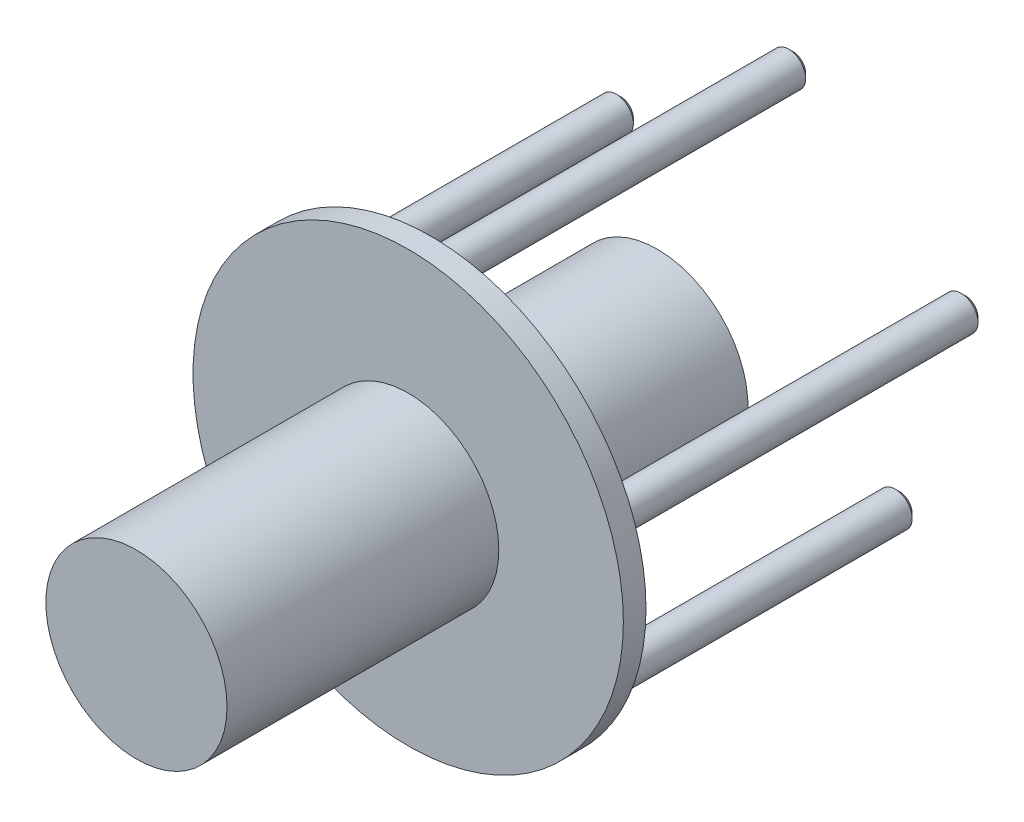
ISO-10303-21;
HEADER;
FILE_DESCRIPTION(('STEP AP214'),'2;1');
FILE_NAME('part.step','',(''),(''),'','','');
FILE_SCHEMA(('AUTOMOTIVE_DESIGN { 1 0 10303 214 1 1 1 1 }'));
ENDSEC;
DATA;
#1=APPLICATION_CONTEXT('core data for automotive mechanical design processes');
#2=APPLICATION_PROTOCOL_DEFINITION('international standard','automotive_design',2000,#1);
#3=PRODUCT_CONTEXT('',#1,'mechanical');
#4=PRODUCT('Part','Part','',(#3));
#5=PRODUCT_RELATED_PRODUCT_CATEGORY('part','',(#4));
#6=PRODUCT_DEFINITION_FORMATION('','',#4);
#7=PRODUCT_DEFINITION_CONTEXT('part definition',#1,'design');
#8=PRODUCT_DEFINITION('design','',#6,#7);
#9=PRODUCT_DEFINITION_SHAPE('','',#8);
#10=(LENGTH_UNIT() NAMED_UNIT(*) SI_UNIT(.MILLI.,.METRE.));
#11=(NAMED_UNIT(*) PLANE_ANGLE_UNIT() SI_UNIT($,.RADIAN.));
#12=(NAMED_UNIT(*) SI_UNIT($,.STERADIAN.) SOLID_ANGLE_UNIT());
#13=UNCERTAINTY_MEASURE_WITH_UNIT(LENGTH_MEASURE(1.E-05),#10,'distance_accuracy_value','');
#14=(GEOMETRIC_REPRESENTATION_CONTEXT(3) GLOBAL_UNCERTAINTY_ASSIGNED_CONTEXT((#13)) GLOBAL_UNIT_ASSIGNED_CONTEXT((#10,
#11,#12)) REPRESENTATION_CONTEXT('',''));
#15=CARTESIAN_POINT('',(0.,0.,0.));
#16=DIRECTION('',(0.,0.,1.));
#17=DIRECTION('',(1.,0.,0.));
#18=AXIS2_PLACEMENT_3D('',#15,#16,#17);
#19=CARTESIAN_POINT('',(-60.5619424894726,11.2111120565077,57.15));
#20=DIRECTION('',(0.,0.,-1.));
#21=DIRECTION('',(-1.,0.,0.));
#22=AXIS2_PLACEMENT_3D('',#19,#20,#21);
#23=CYLINDRICAL_SURFACE('',#22,25.4000000000001);
#24=CARTESIAN_POINT('',(-60.5619424894726,11.2111120565077,57.15));
#25=DIRECTION('',(0.,0.,1.));
#26=DIRECTION('',(1.,0.,0.));
#27=AXIS2_PLACEMENT_3D('',#24,#25,#26);
#28=CIRCLE('',#27,25.4000000000001);
#29=CARTESIAN_POINT('',(-35.1619424894725,11.2111120565077,57.15));
#30=VERTEX_POINT('',#29);
#31=EDGE_CURVE('E53',#30,#30,#28,.T.);
#32=ORIENTED_EDGE('',*,*,#31,.F.);
#33=EDGE_LOOP('',(#32));
#34=FACE_BOUND('',#33,.T.);
#35=CARTESIAN_POINT('',(-60.5619424894727,11.2111120565077,-6.34999999999997));
#36=DIRECTION('',(0.,0.,-1.));
#37=DIRECTION('',(-1.,0.,0.));
#38=AXIS2_PLACEMENT_3D('',#35,#36,#37);
#39=CIRCLE('',#38,25.4000000000001);
#40=CARTESIAN_POINT('',(-85.9619424894728,11.2111120565077,-6.34999999999997));
#41=VERTEX_POINT('',#40);
#42=EDGE_CURVE('E46',#41,#41,#39,.T.);
#43=ORIENTED_EDGE('',*,*,#42,.F.);
#44=EDGE_LOOP('',(#43));
#45=FACE_BOUND('',#44,.T.);
#46=ADVANCED_FACE('F30',(#34,#45),#23,.T.);
#47=CARTESIAN_POINT('',(-60.5619424894726,11.2111120565077,63.5));
#48=DIRECTION('',(0.,0.,-1.));
#49=DIRECTION('',(-1.,0.,0.));
#50=AXIS2_PLACEMENT_3D('',#47,#48,#49);
#51=CYLINDRICAL_SURFACE('',#50,60.325);
#52=CARTESIAN_POINT('',(-60.5619424894726,11.2111120565077,63.5));
#53=DIRECTION('',(0.,0.,1.));
#54=DIRECTION('',(1.,0.,0.));
#55=AXIS2_PLACEMENT_3D('',#52,#53,#54);
#56=CIRCLE('',#55,60.325);
#57=CARTESIAN_POINT('',(-0.236942489472633,11.2111120565077,63.5));
#58=VERTEX_POINT('',#57);
#59=EDGE_CURVE('E50',#58,#58,#56,.T.);
#60=ORIENTED_EDGE('',*,*,#59,.F.);
#61=EDGE_LOOP('',(#60));
#62=FACE_BOUND('',#61,.T.);
#63=CARTESIAN_POINT('',(-60.5619424894726,11.2111120565077,57.15));
#64=DIRECTION('',(0.,0.,1.));
#65=DIRECTION('',(1.,0.,0.));
#66=AXIS2_PLACEMENT_3D('',#63,#64,#65);
#67=CIRCLE('',#66,60.325);
#68=CARTESIAN_POINT('',(-0.236942489472633,11.2111120565077,57.15));
#69=VERTEX_POINT('',#68);
#70=EDGE_CURVE('E49',#69,#69,#67,.T.);
#71=ORIENTED_EDGE('',*,*,#70,.T.);
#72=EDGE_LOOP('',(#71));
#73=FACE_BOUND('',#72,.T.);
#74=ADVANCED_FACE('F116',(#62,#73),#51,.T.);
#75=CARTESIAN_POINT('',(-60.5619424894726,11.2111120565077,63.5));
#76=DIRECTION('',(0.,0.,1.));
#77=DIRECTION('',(1.,0.,0.));
#78=AXIS2_PLACEMENT_3D('',#75,#76,#77);
#79=PLANE('',#78);
#80=CARTESIAN_POINT('',(-60.5619424894726,11.2111120565077,63.5));
#81=DIRECTION('',(0.,0.,1.));
#82=DIRECTION('',(1.,0.,0.));
#83=AXIS2_PLACEMENT_3D('',#80,#81,#82);
#84=CIRCLE('',#83,25.4);
#85=CARTESIAN_POINT('',(-35.1619424894726,11.2111120565077,63.5));
#86=VERTEX_POINT('',#85);
#87=EDGE_CURVE('E10',#86,#86,#84,.T.);
#88=ORIENTED_EDGE('',*,*,#87,.F.);
#89=EDGE_LOOP('',(#88));
#90=FACE_BOUND('',#89,.T.);
#91=ORIENTED_EDGE('',*,*,#59,.T.);
#92=EDGE_LOOP('',(#91));
#93=FACE_BOUND('',#92,.T.);
#94=ADVANCED_FACE('F122',(#90,#93),#79,.T.);
#95=CARTESIAN_POINT('',(-60.5619424894726,11.2111120565077,57.15));
#96=DIRECTION('',(0.,0.,1.));
#97=DIRECTION('',(1.,0.,0.));
#98=AXIS2_PLACEMENT_3D('',#95,#96,#97);
#99=PLANE('',#98);
#100=CARTESIAN_POINT('',(-30.7024516730179,-29.8869512577429,57.15));
#101=DIRECTION('',(0.,0.,1.));
#102=DIRECTION('',(1.,0.,0.));
#103=AXIS2_PLACEMENT_3D('',#100,#101,#102);
#104=CIRCLE('',#103,4.7625);
#105=CARTESIAN_POINT('',(-25.9399516730179,-29.8869512577429,57.15));
#106=VERTEX_POINT('',#105);
#107=EDGE_CURVE('E70',#106,#106,#104,.F.);
#108=ORIENTED_EDGE('',*,*,#107,.F.);
#109=EDGE_LOOP('',(#108));
#110=FACE_BOUND('',#109,.T.);
#111=CARTESIAN_POINT('',(-90.4214333059346,-29.8869512577408,57.15));
#112=DIRECTION('',(0.,0.,1.));
#113=DIRECTION('',(1.,0.,0.));
#114=AXIS2_PLACEMENT_3D('',#111,#112,#113);
#115=CIRCLE('',#114,4.76250000000001);
#116=CARTESIAN_POINT('',(-85.6589333059346,-29.8869512577408,57.15));
#117=VERTEX_POINT('',#116);
#118=EDGE_CURVE('E67',#117,#117,#115,.F.);
#119=ORIENTED_EDGE('',*,*,#118,.F.);
#120=EDGE_LOOP('',(#119));
#121=FACE_BOUND('',#120,.T.);
#122=CARTESIAN_POINT('',(-108.875613517269,26.9091753707559,57.15));
#123=DIRECTION('',(0.,0.,1.));
#124=DIRECTION('',(1.,0.,0.));
#125=AXIS2_PLACEMENT_3D('',#122,#123,#124);
#126=CIRCLE('',#125,4.76250000000002);
#127=CARTESIAN_POINT('',(-104.113113517269,26.9091753707559,57.15));
#128=VERTEX_POINT('',#127);
#129=EDGE_CURVE('E64',#128,#128,#126,.F.);
#130=ORIENTED_EDGE('',*,*,#129,.F.);
#131=EDGE_LOOP('',(#130));
#132=FACE_BOUND('',#131,.T.);
#133=CARTESIAN_POINT('',(-60.5619424894726,62.0111120565074,57.15));
#134=DIRECTION('',(0.,0.,1.));
#135=DIRECTION('',(1.,0.,0.));
#136=AXIS2_PLACEMENT_3D('',#133,#134,#135);
#137=CIRCLE('',#136,4.76249999999999);
#138=CARTESIAN_POINT('',(-55.7994424894726,62.0111120565074,57.15));
#139=VERTEX_POINT('',#138);
#140=EDGE_CURVE('E61',#139,#139,#137,.F.);
#141=ORIENTED_EDGE('',*,*,#140,.F.);
#142=EDGE_LOOP('',(#141));
#143=FACE_BOUND('',#142,.T.);
#144=CARTESIAN_POINT('',(-12.2482714616794,26.9091753707524,57.15));
#145=DIRECTION('',(0.,0.,1.));
#146=DIRECTION('',(1.,0.,0.));
#147=AXIS2_PLACEMENT_3D('',#144,#145,#146);
#148=CIRCLE('',#147,4.7625);
#149=CARTESIAN_POINT('',(-7.48577146167936,26.9091753707524,57.15));
#150=VERTEX_POINT('',#149);
#151=EDGE_CURVE('E58',#150,#150,#148,.F.);
#152=ORIENTED_EDGE('',*,*,#151,.F.);
#153=EDGE_LOOP('',(#152));
#154=FACE_BOUND('',#153,.T.);
#155=ORIENTED_EDGE('',*,*,#31,.T.);
#156=EDGE_LOOP('',(#155));
#157=FACE_BOUND('',#156,.T.);
#158=ORIENTED_EDGE('',*,*,#70,.F.);
#159=EDGE_LOOP('',(#158));
#160=FACE_BOUND('',#159,.T.);
#161=ADVANCED_FACE('F183',(#110,#121,#132,#143,#154,#157,#160),#99,.F.);
#162=CARTESIAN_POINT('',(-12.2482714616794,26.9091753707524,57.15));
#163=DIRECTION('',(0.,0.,-1.));
#164=DIRECTION('',(-1.,0.,0.));
#165=AXIS2_PLACEMENT_3D('',#162,#163,#164);
#166=CYLINDRICAL_SURFACE('',#165,4.7625);
#167=CARTESIAN_POINT('',(-12.2482714616794,26.9091753707524,-43.18));
#168=DIRECTION('',(0.,0.,-1.));
#169=DIRECTION('',(-1.,0.,0.));
#170=AXIS2_PLACEMENT_3D('',#167,#168,#169);
#171=CIRCLE('',#170,4.7625);
#172=CARTESIAN_POINT('',(-17.0107714616794,26.9091753707524,-43.18));
#173=VERTEX_POINT('',#172);
#174=EDGE_CURVE('E34',#173,#173,#171,.F.);
#175=ORIENTED_EDGE('',*,*,#174,.T.);
#176=EDGE_LOOP('',(#175));
#177=FACE_BOUND('',#176,.T.);
#178=ORIENTED_EDGE('',*,*,#151,.T.);
#179=EDGE_LOOP('',(#178));
#180=FACE_BOUND('',#179,.T.);
#181=ADVANCED_FACE('F179',(#177,#180),#166,.T.);
#182=CARTESIAN_POINT('',(-60.5619424894726,62.0111120565074,57.15));
#183=DIRECTION('',(0.,0.,-1.));
#184=DIRECTION('',(-1.,0.,0.));
#185=AXIS2_PLACEMENT_3D('',#182,#183,#184);
#186=CYLINDRICAL_SURFACE('',#185,4.76249999999999);
#187=CARTESIAN_POINT('',(-60.5619424894726,62.0111120565074,-43.1800000000028));
#188=DIRECTION('',(0.,0.,-1.));
#189=DIRECTION('',(-1.,0.,0.));
#190=AXIS2_PLACEMENT_3D('',#187,#188,#189);
#191=CIRCLE('',#190,4.76249999999999);
#192=CARTESIAN_POINT('',(-65.3244424894726,62.0111120565074,-43.1800000000028));
#193=VERTEX_POINT('',#192);
#194=EDGE_CURVE('E94',#193,#193,#191,.F.);
#195=ORIENTED_EDGE('',*,*,#194,.T.);
#196=EDGE_LOOP('',(#195));
#197=FACE_BOUND('',#196,.T.);
#198=ORIENTED_EDGE('',*,*,#140,.T.);
#199=EDGE_LOOP('',(#198));
#200=FACE_BOUND('',#199,.T.);
#201=ADVANCED_FACE('F175',(#197,#200),#186,.T.);
#202=CARTESIAN_POINT('',(-108.875613517269,26.9091753707559,57.15));
#203=DIRECTION('',(0.,0.,-1.));
#204=DIRECTION('',(-1.,0.,0.));
#205=AXIS2_PLACEMENT_3D('',#202,#203,#204);
#206=CYLINDRICAL_SURFACE('',#205,4.76250000000002);
#207=CARTESIAN_POINT('',(-108.875613517269,26.9091753707559,-43.1800000000047));
#208=DIRECTION('',(0.,0.,-1.));
#209=DIRECTION('',(-1.,0.,0.));
#210=AXIS2_PLACEMENT_3D('',#207,#208,#209);
#211=CIRCLE('',#210,4.76250000000002);
#212=CARTESIAN_POINT('',(-113.638113517269,26.9091753707559,-43.1800000000047));
#213=VERTEX_POINT('',#212);
#214=EDGE_CURVE('E82',#213,#213,#211,.F.);
#215=ORIENTED_EDGE('',*,*,#214,.T.);
#216=EDGE_LOOP('',(#215));
#217=FACE_BOUND('',#216,.T.);
#218=ORIENTED_EDGE('',*,*,#129,.T.);
#219=EDGE_LOOP('',(#218));
#220=FACE_BOUND('',#219,.T.);
#221=ADVANCED_FACE('F171',(#217,#220),#206,.T.);
#222=CARTESIAN_POINT('',(-90.4214333059346,-29.8869512577408,57.15));
#223=DIRECTION('',(0.,0.,-1.));
#224=DIRECTION('',(-1.,0.,0.));
#225=AXIS2_PLACEMENT_3D('',#222,#223,#224);
#226=CYLINDRICAL_SURFACE('',#225,4.76250000000001);
#227=CARTESIAN_POINT('',(-90.4214333059346,-29.8869512577408,-43.1800000000031));
#228=DIRECTION('',(0.,0.,-1.));
#229=DIRECTION('',(-1.,0.,0.));
#230=AXIS2_PLACEMENT_3D('',#227,#228,#229);
#231=CIRCLE('',#230,4.76250000000001);
#232=CARTESIAN_POINT('',(-95.1839333059346,-29.8869512577408,-43.1800000000031));
#233=VERTEX_POINT('',#232);
#234=EDGE_CURVE('E76',#233,#233,#231,.F.);
#235=ORIENTED_EDGE('',*,*,#234,.T.);
#236=EDGE_LOOP('',(#235));
#237=FACE_BOUND('',#236,.T.);
#238=ORIENTED_EDGE('',*,*,#118,.T.);
#239=EDGE_LOOP('',(#238));
#240=FACE_BOUND('',#239,.T.);
#241=ADVANCED_FACE('F167',(#237,#240),#226,.T.);
#242=CARTESIAN_POINT('',(-30.7024516730179,-29.8869512577429,57.15));
#243=DIRECTION('',(0.,0.,-1.));
#244=DIRECTION('',(-1.,0.,0.));
#245=AXIS2_PLACEMENT_3D('',#242,#243,#244);
#246=CYLINDRICAL_SURFACE('',#245,4.7625);
#247=CARTESIAN_POINT('',(-30.7024516730179,-29.8869512577429,-43.1800000000002));
#248=DIRECTION('',(0.,0.,-1.));
#249=DIRECTION('',(-1.,0.,0.));
#250=AXIS2_PLACEMENT_3D('',#247,#248,#249);
#251=CIRCLE('',#250,4.7625);
#252=CARTESIAN_POINT('',(-35.4649516730179,-29.8869512577429,-43.1800000000002));
#253=VERTEX_POINT('',#252);
#254=EDGE_CURVE('E88',#253,#253,#251,.F.);
#255=ORIENTED_EDGE('',*,*,#254,.T.);
#256=EDGE_LOOP('',(#255));
#257=FACE_BOUND('',#256,.T.);
#258=ORIENTED_EDGE('',*,*,#107,.T.);
#259=EDGE_LOOP('',(#258));
#260=FACE_BOUND('',#259,.T.);
#261=ADVANCED_FACE('F163',(#257,#260),#246,.T.);
#262=CARTESIAN_POINT('',(-60.5619424894727,11.2111120565077,-6.34999999999997));
#263=DIRECTION('',(0.,0.,-1.));
#264=DIRECTION('',(-1.,0.,0.));
#265=AXIS2_PLACEMENT_3D('',#262,#263,#264);
#266=PLANE('',#265);
#267=ORIENTED_EDGE('',*,*,#42,.T.);
#268=EDGE_LOOP('',(#267));
#269=FACE_BOUND('',#268,.T.);
#270=ADVANCED_FACE('F157',(#269),#266,.T.);
#271=CARTESIAN_POINT('',(-12.2482714616794,26.9091753707524,-44.45));
#272=DIRECTION('',(0.,0.,-1.));
#273=DIRECTION('',(-1.,0.,0.));
#274=AXIS2_PLACEMENT_3D('',#271,#272,#273);
#275=PLANE('',#274);
#276=CARTESIAN_POINT('',(-12.2482714616794,26.9091753707524,-44.45));
#277=DIRECTION('',(0.,0.,-1.));
#278=DIRECTION('',(-1.,0.,0.));
#279=AXIS2_PLACEMENT_3D('',#276,#277,#278);
#280=CIRCLE('',#279,3.49250000000001);
#281=CARTESIAN_POINT('',(-15.7407714616794,26.9091753707524,-44.45));
#282=VERTEX_POINT('',#281);
#283=EDGE_CURVE('E42',#282,#282,#280,.T.);
#284=ORIENTED_EDGE('',*,*,#283,.T.);
#285=EDGE_LOOP('',(#284));
#286=FACE_BOUND('',#285,.T.);
#287=ADVANCED_FACE('F99',(#286),#275,.T.);
#288=CARTESIAN_POINT('',(-30.7024516730177,-29.88695125774,-44.45));
#289=DIRECTION('',(0.,0.,-1.));
#290=DIRECTION('',(-1.,0.,0.));
#291=AXIS2_PLACEMENT_3D('',#288,#289,#290);
#292=PLANE('',#291);
#293=CARTESIAN_POINT('',(-30.7024516730179,-29.8869512577429,-44.45));
#294=DIRECTION('',(0.,0.,-1.));
#295=DIRECTION('',(-1.,0.,0.));
#296=AXIS2_PLACEMENT_3D('',#293,#294,#295);
#297=CIRCLE('',#296,3.49250000000017);
#298=CARTESIAN_POINT('',(-34.1949516730181,-29.8869512577429,-44.45));
#299=VERTEX_POINT('',#298);
#300=EDGE_CURVE('E85',#299,#299,#297,.T.);
#301=ORIENTED_EDGE('',*,*,#300,.T.);
#302=EDGE_LOOP('',(#301));
#303=FACE_BOUND('',#302,.T.);
#304=ADVANCED_FACE('F146',(#303),#292,.T.);
#305=CARTESIAN_POINT('',(-90.4214333059315,-29.8869512577371,-44.45));
#306=DIRECTION('',(0.,0.,-1.));
#307=DIRECTION('',(-1.,0.,0.));
#308=AXIS2_PLACEMENT_3D('',#305,#306,#307);
#309=PLANE('',#308);
#310=CARTESIAN_POINT('',(-90.4214333059346,-29.8869512577408,-44.45));
#311=DIRECTION('',(0.,0.,-1.));
#312=DIRECTION('',(-1.,0.,0.));
#313=AXIS2_PLACEMENT_3D('',#310,#311,#312);
#314=CIRCLE('',#313,3.49250000000309);
#315=CARTESIAN_POINT('',(-93.9139333059377,-29.8869512577408,-44.45));
#316=VERTEX_POINT('',#315);
#317=EDGE_CURVE('E73',#316,#316,#314,.T.);
#318=ORIENTED_EDGE('',*,*,#317,.T.);
#319=EDGE_LOOP('',(#318));
#320=FACE_BOUND('',#319,.T.);
#321=ADVANCED_FACE('F148',(#320),#309,.T.);
#322=CARTESIAN_POINT('',(-108.875613517264,26.9091753707571,-44.45));
#323=DIRECTION('',(0.,0.,-1.));
#324=DIRECTION('',(-1.,0.,0.));
#325=AXIS2_PLACEMENT_3D('',#322,#323,#324);
#326=PLANE('',#325);
#327=CARTESIAN_POINT('',(-108.875613517269,26.9091753707559,-44.45));
#328=DIRECTION('',(0.,0.,-1.));
#329=DIRECTION('',(-1.,0.,0.));
#330=AXIS2_PLACEMENT_3D('',#327,#328,#329);
#331=CIRCLE('',#330,3.49250000000464);
#332=CARTESIAN_POINT('',(-112.368113517274,26.9091753707559,-44.45));
#333=VERTEX_POINT('',#332);
#334=EDGE_CURVE('E79',#333,#333,#331,.T.);
#335=ORIENTED_EDGE('',*,*,#334,.T.);
#336=EDGE_LOOP('',(#335));
#337=FACE_BOUND('',#336,.T.);
#338=ADVANCED_FACE('F154',(#337),#326,.T.);
#339=CARTESIAN_POINT('',(-60.5619424894699,62.0111120565064,-44.45));
#340=DIRECTION('',(0.,0.,-1.));
#341=DIRECTION('',(-1.,0.,0.));
#342=AXIS2_PLACEMENT_3D('',#339,#340,#341);
#343=PLANE('',#342);
#344=CARTESIAN_POINT('',(-60.5619424894726,62.0111120565074,-44.45));
#345=DIRECTION('',(0.,0.,-1.));
#346=DIRECTION('',(-1.,0.,0.));
#347=AXIS2_PLACEMENT_3D('',#344,#345,#346);
#348=CIRCLE('',#347,3.49250000000276);
#349=CARTESIAN_POINT('',(-64.0544424894754,62.0111120565074,-44.45));
#350=VERTEX_POINT('',#349);
#351=EDGE_CURVE('E91',#350,#350,#348,.T.);
#352=ORIENTED_EDGE('',*,*,#351,.T.);
#353=EDGE_LOOP('',(#352));
#354=FACE_BOUND('',#353,.T.);
#355=ADVANCED_FACE('F133',(#354),#343,.T.);
#356=CARTESIAN_POINT('',(-90.4214333059346,-29.8869512577408,-44.45));
#357=DIRECTION('',(0.,0.,1.));
#358=DIRECTION('',(1.,0.,0.));
#359=AXIS2_PLACEMENT_3D('',#356,#357,#358);
#360=CONICAL_SURFACE('',#359,3.49250000000309,0.785398163397451);
#361=ORIENTED_EDGE('',*,*,#234,.F.);
#362=EDGE_LOOP('',(#361));
#363=FACE_BOUND('',#362,.T.);
#364=ORIENTED_EDGE('',*,*,#317,.F.);
#365=EDGE_LOOP('',(#364));
#366=FACE_BOUND('',#365,.T.);
#367=ADVANCED_FACE('F129',(#363,#366),#360,.T.);
#368=CARTESIAN_POINT('',(-108.875613517269,26.9091753707559,-44.45));
#369=DIRECTION('',(0.,0.,1.));
#370=DIRECTION('',(1.,0.,0.));
#371=AXIS2_PLACEMENT_3D('',#368,#369,#370);
#372=CONICAL_SURFACE('',#371,3.49250000000464,0.785398163397446);
#373=ORIENTED_EDGE('',*,*,#214,.F.);
#374=EDGE_LOOP('',(#373));
#375=FACE_BOUND('',#374,.T.);
#376=ORIENTED_EDGE('',*,*,#334,.F.);
#377=EDGE_LOOP('',(#376));
#378=FACE_BOUND('',#377,.T.);
#379=ADVANCED_FACE('F132',(#375,#378),#372,.T.);
#380=CARTESIAN_POINT('',(-30.7024516730179,-29.8869512577429,-44.45));
#381=DIRECTION('',(0.,0.,1.));
#382=DIRECTION('',(1.,0.,0.));
#383=AXIS2_PLACEMENT_3D('',#380,#381,#382);
#384=CONICAL_SURFACE('',#383,3.49250000000017,0.785398163397449);
#385=ORIENTED_EDGE('',*,*,#254,.F.);
#386=EDGE_LOOP('',(#385));
#387=FACE_BOUND('',#386,.T.);
#388=ORIENTED_EDGE('',*,*,#300,.F.);
#389=EDGE_LOOP('',(#388));
#390=FACE_BOUND('',#389,.T.);
#391=ADVANCED_FACE('F112',(#387,#390),#384,.T.);
#392=CARTESIAN_POINT('',(-60.5619424894726,62.0111120565074,-44.45));
#393=DIRECTION('',(0.,0.,1.));
#394=DIRECTION('',(1.,0.,0.));
#395=AXIS2_PLACEMENT_3D('',#392,#393,#394);
#396=CONICAL_SURFACE('',#395,3.49250000000276,0.785398163397445);
#397=ORIENTED_EDGE('',*,*,#194,.F.);
#398=EDGE_LOOP('',(#397));
#399=FACE_BOUND('',#398,.T.);
#400=ORIENTED_EDGE('',*,*,#351,.F.);
#401=EDGE_LOOP('',(#400));
#402=FACE_BOUND('',#401,.T.);
#403=ADVANCED_FACE('F103',(#399,#402),#396,.T.);
#404=CARTESIAN_POINT('',(-12.2482714616794,26.9091753707524,-44.45));
#405=DIRECTION('',(0.,0.,1.));
#406=DIRECTION('',(1.,0.,0.));
#407=AXIS2_PLACEMENT_3D('',#404,#405,#406);
#408=CONICAL_SURFACE('',#407,3.49250000000001,0.785398163397443);
#409=ORIENTED_EDGE('',*,*,#174,.F.);
#410=EDGE_LOOP('',(#409));
#411=FACE_BOUND('',#410,.T.);
#412=ORIENTED_EDGE('',*,*,#283,.F.);
#413=EDGE_LOOP('',(#412));
#414=FACE_BOUND('',#413,.T.);
#415=ADVANCED_FACE('F32',(#411,#414),#408,.T.);
#416=CARTESIAN_POINT('',(-60.5619424894726,11.2111120565077,139.7));
#417=DIRECTION('',(0.,0.,-1.));
#418=DIRECTION('',(-1.,0.,0.));
#419=AXIS2_PLACEMENT_3D('',#416,#417,#418);
#420=CYLINDRICAL_SURFACE('',#419,25.4);
#421=CARTESIAN_POINT('',(-60.5619424894726,11.2111120565077,139.7));
#422=DIRECTION('',(0.,0.,1.));
#423=DIRECTION('',(1.,0.,0.));
#424=AXIS2_PLACEMENT_3D('',#421,#422,#423);
#425=CIRCLE('',#424,25.4);
#426=CARTESIAN_POINT('',(-35.1619424894726,11.2111120565077,139.7));
#427=VERTEX_POINT('',#426);
#428=EDGE_CURVE('E45',#427,#427,#425,.T.);
#429=ORIENTED_EDGE('',*,*,#428,.F.);
#430=EDGE_LOOP('',(#429));
#431=FACE_BOUND('',#430,.T.);
#432=ORIENTED_EDGE('',*,*,#87,.T.);
#433=EDGE_LOOP('',(#432));
#434=FACE_BOUND('',#433,.T.);
#435=ADVANCED_FACE('F102',(#431,#434),#420,.T.);
#436=CARTESIAN_POINT('',(-60.5619424894726,11.2111120565077,139.7));
#437=DIRECTION('',(0.,0.,1.));
#438=DIRECTION('',(1.,0.,0.));
#439=AXIS2_PLACEMENT_3D('',#436,#437,#438);
#440=PLANE('',#439);
#441=ORIENTED_EDGE('',*,*,#428,.T.);
#442=EDGE_LOOP('',(#441));
#443=FACE_BOUND('',#442,.T.);
#444=ADVANCED_FACE('F109',(#443),#440,.T.);
#445=CLOSED_SHELL('',(#46,#74,#94,#161,#181,#201,#221,#241,#261,#270,#287,#304,#321,#338,#355,
#367,#379,#391,#403,#415,#435,#444));
#446=MANIFOLD_SOLID_BREP('B2',#445);
#447=ADVANCED_BREP_SHAPE_REPRESENTATION('',(#18,#446),#14);
#448=SHAPE_DEFINITION_REPRESENTATION(#9,#447);
ENDSEC;
END-ISO-10303-21;
